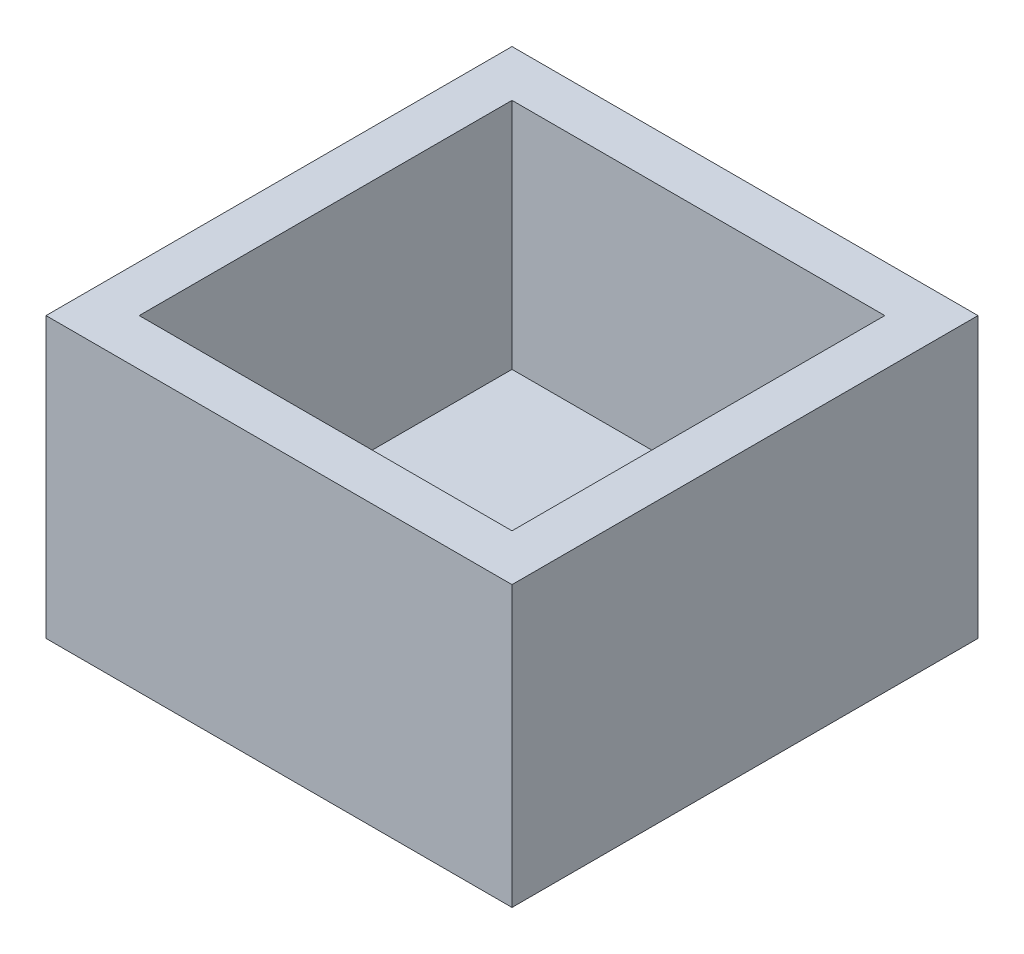
ISO-10303-21;
HEADER;
FILE_DESCRIPTION(('STEP AP214'),'2;1');
FILE_NAME('part.step','',(''),(''),'','','');
FILE_SCHEMA(('AUTOMOTIVE_DESIGN { 1 0 10303 214 1 1 1 1 }'));
ENDSEC;
DATA;
#1=APPLICATION_CONTEXT('core data for automotive mechanical design processes');
#2=APPLICATION_PROTOCOL_DEFINITION('international standard','automotive_design',2000,#1);
#3=PRODUCT_CONTEXT('',#1,'mechanical');
#4=PRODUCT('Part','Part','',(#3));
#5=PRODUCT_RELATED_PRODUCT_CATEGORY('part','',(#4));
#6=PRODUCT_DEFINITION_FORMATION('','',#4);
#7=PRODUCT_DEFINITION_CONTEXT('part definition',#1,'design');
#8=PRODUCT_DEFINITION('design','',#6,#7);
#9=PRODUCT_DEFINITION_SHAPE('','',#8);
#10=(LENGTH_UNIT() NAMED_UNIT(*) SI_UNIT(.MILLI.,.METRE.));
#11=(NAMED_UNIT(*) PLANE_ANGLE_UNIT() SI_UNIT($,.RADIAN.));
#12=(NAMED_UNIT(*) SI_UNIT($,.STERADIAN.) SOLID_ANGLE_UNIT());
#13=UNCERTAINTY_MEASURE_WITH_UNIT(LENGTH_MEASURE(1.E-05),#10,'distance_accuracy_value','');
#14=(GEOMETRIC_REPRESENTATION_CONTEXT(3) GLOBAL_UNCERTAINTY_ASSIGNED_CONTEXT((#13)) GLOBAL_UNIT_ASSIGNED_CONTEXT((#10,
#11,#12)) REPRESENTATION_CONTEXT('',''));
#15=CARTESIAN_POINT('',(0.,0.,0.));
#16=DIRECTION('',(0.,0.,1.));
#17=DIRECTION('',(1.,0.,0.));
#18=AXIS2_PLACEMENT_3D('',#15,#16,#17);
#19=CARTESIAN_POINT('',(0.,1.,0.));
#20=DIRECTION('',(1.,0.,0.));
#21=DIRECTION('',(0.,0.,-1.));
#22=AXIS2_PLACEMENT_3D('',#19,#20,#21);
#23=PLANE('',#22);
#24=DIRECTION('',(0.,0.,1.));
#25=VECTOR('',#24,1.);
#26=CARTESIAN_POINT('',(0.,0.,0.));
#27=LINE('',#26,#25);
#28=CARTESIAN_POINT('',(0.,0.,0.));
#29=VERTEX_POINT('',#28);
#30=CARTESIAN_POINT('',(0.,0.,10.));
#31=VERTEX_POINT('',#30);
#32=EDGE_CURVE('E167',#29,#31,#27,.T.);
#33=ORIENTED_EDGE('',*,*,#32,.T.);
#34=DIRECTION('',(0.,-1.,0.));
#35=VECTOR('',#34,1.);
#36=CARTESIAN_POINT('',(0.,1.,10.));
#37=LINE('',#36,#35);
#38=CARTESIAN_POINT('',(0.,6.,10.));
#39=VERTEX_POINT('',#38);
#40=EDGE_CURVE('E11',#39,#31,#37,.T.);
#41=ORIENTED_EDGE('',*,*,#40,.F.);
#42=DIRECTION('',(0.,0.,1.));
#43=VECTOR('',#42,1.);
#44=CARTESIAN_POINT('',(0.,6.,0.));
#45=LINE('',#44,#43);
#46=CARTESIAN_POINT('',(0.,6.,0.));
#47=VERTEX_POINT('',#46);
#48=EDGE_CURVE('E120',#47,#39,#45,.T.);
#49=ORIENTED_EDGE('',*,*,#48,.F.);
#50=DIRECTION('',(0.,-1.,0.));
#51=VECTOR('',#50,1.);
#52=CARTESIAN_POINT('',(0.,1.,0.));
#53=LINE('',#52,#51);
#54=EDGE_CURVE('E180',#47,#29,#53,.T.);
#55=ORIENTED_EDGE('',*,*,#54,.T.);
#56=EDGE_LOOP('',(#33,#41,#49,#55));
#57=FACE_BOUND('',#56,.T.);
#58=ADVANCED_FACE('F39',(#57),#23,.F.);
#59=CARTESIAN_POINT('',(0.,1.,10.));
#60=DIRECTION('',(0.,0.,-1.));
#61=DIRECTION('',(-1.,0.,0.));
#62=AXIS2_PLACEMENT_3D('',#59,#60,#61);
#63=PLANE('',#62);
#64=DIRECTION('',(1.,0.,0.));
#65=VECTOR('',#64,1.);
#66=CARTESIAN_POINT('',(0.,0.,10.));
#67=LINE('',#66,#65);
#68=CARTESIAN_POINT('',(10.,0.,10.));
#69=VERTEX_POINT('',#68);
#70=EDGE_CURVE('E171',#31,#69,#67,.T.);
#71=ORIENTED_EDGE('',*,*,#70,.T.);
#72=DIRECTION('',(0.,-1.,0.));
#73=VECTOR('',#72,1.);
#74=CARTESIAN_POINT('',(10.,1.,10.));
#75=LINE('',#74,#73);
#76=CARTESIAN_POINT('',(10.,6.,10.));
#77=VERTEX_POINT('',#76);
#78=EDGE_CURVE('E47',#77,#69,#75,.T.);
#79=ORIENTED_EDGE('',*,*,#78,.F.);
#80=DIRECTION('',(1.,0.,0.));
#81=VECTOR('',#80,1.);
#82=CARTESIAN_POINT('',(0.,6.,10.));
#83=LINE('',#82,#81);
#84=EDGE_CURVE('E155',#39,#77,#83,.T.);
#85=ORIENTED_EDGE('',*,*,#84,.F.);
#86=ORIENTED_EDGE('',*,*,#40,.T.);
#87=EDGE_LOOP('',(#71,#79,#85,#86));
#88=FACE_BOUND('',#87,.T.);
#89=ADVANCED_FACE('F205',(#88),#63,.F.);
#90=CARTESIAN_POINT('',(10.,1.,0.));
#91=DIRECTION('',(-1.,0.,0.));
#92=DIRECTION('',(0.,0.,1.));
#93=AXIS2_PLACEMENT_3D('',#90,#91,#92);
#94=PLANE('',#93);
#95=DIRECTION('',(0.,0.,-1.));
#96=VECTOR('',#95,1.);
#97=CARTESIAN_POINT('',(10.,0.,0.));
#98=LINE('',#97,#96);
#99=CARTESIAN_POINT('',(10.,0.,0.));
#100=VERTEX_POINT('',#99);
#101=EDGE_CURVE('E174',#69,#100,#98,.T.);
#102=ORIENTED_EDGE('',*,*,#101,.T.);
#103=DIRECTION('',(0.,-1.,0.));
#104=VECTOR('',#103,1.);
#105=CARTESIAN_POINT('',(10.,1.,0.));
#106=LINE('',#105,#104);
#107=CARTESIAN_POINT('',(10.,6.,0.));
#108=VERTEX_POINT('',#107);
#109=EDGE_CURVE('E184',#108,#100,#106,.T.);
#110=ORIENTED_EDGE('',*,*,#109,.F.);
#111=DIRECTION('',(0.,0.,-1.));
#112=VECTOR('',#111,1.);
#113=CARTESIAN_POINT('',(10.,6.,0.));
#114=LINE('',#113,#112);
#115=EDGE_CURVE('E159',#77,#108,#114,.T.);
#116=ORIENTED_EDGE('',*,*,#115,.F.);
#117=ORIENTED_EDGE('',*,*,#78,.T.);
#118=EDGE_LOOP('',(#102,#110,#116,#117));
#119=FACE_BOUND('',#118,.T.);
#120=ADVANCED_FACE('F192',(#119),#94,.F.);
#121=CARTESIAN_POINT('',(0.,1.,0.));
#122=DIRECTION('',(0.,0.,1.));
#123=DIRECTION('',(1.,0.,0.));
#124=AXIS2_PLACEMENT_3D('',#121,#122,#123);
#125=PLANE('',#124);
#126=DIRECTION('',(-1.,0.,0.));
#127=VECTOR('',#126,1.);
#128=CARTESIAN_POINT('',(0.,0.,0.));
#129=LINE('',#128,#127);
#130=EDGE_CURVE('E177',#100,#29,#129,.T.);
#131=ORIENTED_EDGE('',*,*,#130,.T.);
#132=ORIENTED_EDGE('',*,*,#54,.F.);
#133=DIRECTION('',(-1.,0.,0.));
#134=VECTOR('',#133,1.);
#135=CARTESIAN_POINT('',(0.,6.,0.));
#136=LINE('',#135,#134);
#137=EDGE_CURVE('E163',#108,#47,#136,.T.);
#138=ORIENTED_EDGE('',*,*,#137,.F.);
#139=ORIENTED_EDGE('',*,*,#109,.T.);
#140=EDGE_LOOP('',(#131,#132,#138,#139));
#141=FACE_BOUND('',#140,.T.);
#142=ADVANCED_FACE('F200',(#141),#125,.F.);
#143=CARTESIAN_POINT('',(0.,0.,0.));
#144=DIRECTION('',(0.,1.,0.));
#145=DIRECTION('',(0.,0.,1.));
#146=AXIS2_PLACEMENT_3D('',#143,#144,#145);
#147=PLANE('',#146);
#148=ORIENTED_EDGE('',*,*,#32,.F.);
#149=ORIENTED_EDGE('',*,*,#130,.F.);
#150=ORIENTED_EDGE('',*,*,#101,.F.);
#151=ORIENTED_EDGE('',*,*,#70,.F.);
#152=EDGE_LOOP('',(#148,#149,#150,#151));
#153=FACE_BOUND('',#152,.T.);
#154=ADVANCED_FACE('F198',(#153),#147,.F.);
#155=CARTESIAN_POINT('',(0.,6.,0.));
#156=DIRECTION('',(0.,1.,0.));
#157=DIRECTION('',(0.,0.,1.));
#158=AXIS2_PLACEMENT_3D('',#155,#156,#157);
#159=PLANE('',#158);
#160=ORIENTED_EDGE('',*,*,#48,.T.);
#161=ORIENTED_EDGE('',*,*,#84,.T.);
#162=ORIENTED_EDGE('',*,*,#115,.T.);
#163=ORIENTED_EDGE('',*,*,#137,.T.);
#164=EDGE_LOOP('',(#160,#161,#162,#163));
#165=FACE_BOUND('',#164,.T.);
#166=DIRECTION('',(1.,0.,0.));
#167=VECTOR('',#166,1.);
#168=CARTESIAN_POINT('',(0.999999999999999,6.,9.));
#169=LINE('',#168,#167);
#170=CARTESIAN_POINT('',(0.999999999999999,6.,9.));
#171=VERTEX_POINT('',#170);
#172=CARTESIAN_POINT('',(9.,6.,9.));
#173=VERTEX_POINT('',#172);
#174=EDGE_CURVE('E113',#171,#173,#169,.T.);
#175=ORIENTED_EDGE('',*,*,#174,.F.);
#176=DIRECTION('',(0.,0.,1.));
#177=VECTOR('',#176,1.);
#178=CARTESIAN_POINT('',(0.999999999999997,6.,1.));
#179=LINE('',#178,#177);
#180=CARTESIAN_POINT('',(0.999999999999997,6.,1.));
#181=VERTEX_POINT('',#180);
#182=EDGE_CURVE('E103',#181,#171,#179,.T.);
#183=ORIENTED_EDGE('',*,*,#182,.F.);
#184=DIRECTION('',(-1.,0.,0.));
#185=VECTOR('',#184,1.);
#186=CARTESIAN_POINT('',(0.999999999999997,6.,1.));
#187=LINE('',#186,#185);
#188=CARTESIAN_POINT('',(9.,6.,1.));
#189=VERTEX_POINT('',#188);
#190=EDGE_CURVE('E130',#189,#181,#187,.T.);
#191=ORIENTED_EDGE('',*,*,#190,.F.);
#192=DIRECTION('',(0.,0.,-1.));
#193=VECTOR('',#192,1.);
#194=CARTESIAN_POINT('',(9.,6.,1.));
#195=LINE('',#194,#193);
#196=EDGE_CURVE('E126',#173,#189,#195,.T.);
#197=ORIENTED_EDGE('',*,*,#196,.F.);
#198=EDGE_LOOP('',(#175,#183,#191,#197));
#199=FACE_BOUND('',#198,.T.);
#200=ADVANCED_FACE('F124',(#165,#199),#159,.T.);
#201=CARTESIAN_POINT('',(0.999999999999997,6.,1.));
#202=DIRECTION('',(1.,0.,0.));
#203=DIRECTION('',(0.,0.,-1.));
#204=AXIS2_PLACEMENT_3D('',#201,#202,#203);
#205=PLANE('',#204);
#206=DIRECTION('',(0.,0.,1.));
#207=VECTOR('',#206,1.);
#208=CARTESIAN_POINT('',(0.999999999999997,1.,1.));
#209=LINE('',#208,#207);
#210=CARTESIAN_POINT('',(0.999999999999997,1.,1.));
#211=VERTEX_POINT('',#210);
#212=CARTESIAN_POINT('',(0.999999999999999,1.,9.));
#213=VERTEX_POINT('',#212);
#214=EDGE_CURVE('E54',#211,#213,#209,.T.);
#215=ORIENTED_EDGE('',*,*,#214,.F.);
#216=DIRECTION('',(0.,-1.,0.));
#217=VECTOR('',#216,1.);
#218=CARTESIAN_POINT('',(0.999999999999997,6.,1.));
#219=LINE('',#218,#217);
#220=EDGE_CURVE('E108',#181,#211,#219,.T.);
#221=ORIENTED_EDGE('',*,*,#220,.F.);
#222=ORIENTED_EDGE('',*,*,#182,.T.);
#223=DIRECTION('',(0.,-1.,0.));
#224=VECTOR('',#223,1.);
#225=CARTESIAN_POINT('',(0.999999999999999,6.,9.));
#226=LINE('',#225,#224);
#227=EDGE_CURVE('E106',#171,#213,#226,.T.);
#228=ORIENTED_EDGE('',*,*,#227,.T.);
#229=EDGE_LOOP('',(#215,#221,#222,#228));
#230=FACE_BOUND('',#229,.T.);
#231=ADVANCED_FACE('F105',(#230),#205,.T.);
#232=CARTESIAN_POINT('',(0.999999999999999,6.,9.));
#233=DIRECTION('',(0.,0.,-1.));
#234=DIRECTION('',(-1.,0.,0.));
#235=AXIS2_PLACEMENT_3D('',#232,#233,#234);
#236=PLANE('',#235);
#237=DIRECTION('',(1.,0.,0.));
#238=VECTOR('',#237,1.);
#239=CARTESIAN_POINT('',(0.999999999999999,1.,9.));
#240=LINE('',#239,#238);
#241=CARTESIAN_POINT('',(9.,1.,9.));
#242=VERTEX_POINT('',#241);
#243=EDGE_CURVE('E58',#213,#242,#240,.T.);
#244=ORIENTED_EDGE('',*,*,#243,.F.);
#245=ORIENTED_EDGE('',*,*,#227,.F.);
#246=ORIENTED_EDGE('',*,*,#174,.T.);
#247=DIRECTION('',(0.,-1.,0.));
#248=VECTOR('',#247,1.);
#249=CARTESIAN_POINT('',(9.,6.,9.));
#250=LINE('',#249,#248);
#251=EDGE_CURVE('E121',#173,#242,#250,.T.);
#252=ORIENTED_EDGE('',*,*,#251,.T.);
#253=EDGE_LOOP('',(#244,#245,#246,#252));
#254=FACE_BOUND('',#253,.T.);
#255=ADVANCED_FACE('F117',(#254),#236,.T.);
#256=CARTESIAN_POINT('',(9.,6.,1.));
#257=DIRECTION('',(-1.,0.,0.));
#258=DIRECTION('',(0.,0.,1.));
#259=AXIS2_PLACEMENT_3D('',#256,#257,#258);
#260=PLANE('',#259);
#261=DIRECTION('',(0.,0.,-1.));
#262=VECTOR('',#261,1.);
#263=CARTESIAN_POINT('',(9.,1.,1.));
#264=LINE('',#263,#262);
#265=CARTESIAN_POINT('',(9.,1.,1.));
#266=VERTEX_POINT('',#265);
#267=EDGE_CURVE('E139',#242,#266,#264,.T.);
#268=ORIENTED_EDGE('',*,*,#267,.F.);
#269=ORIENTED_EDGE('',*,*,#251,.F.);
#270=ORIENTED_EDGE('',*,*,#196,.T.);
#271=DIRECTION('',(0.,-1.,0.));
#272=VECTOR('',#271,1.);
#273=CARTESIAN_POINT('',(9.,6.,1.));
#274=LINE('',#273,#272);
#275=EDGE_CURVE('E146',#189,#266,#274,.T.);
#276=ORIENTED_EDGE('',*,*,#275,.T.);
#277=EDGE_LOOP('',(#268,#269,#270,#276));
#278=FACE_BOUND('',#277,.T.);
#279=ADVANCED_FACE('F227',(#278),#260,.T.);
#280=CARTESIAN_POINT('',(0.999999999999997,6.,1.));
#281=DIRECTION('',(0.,0.,1.));
#282=DIRECTION('',(1.,0.,0.));
#283=AXIS2_PLACEMENT_3D('',#280,#281,#282);
#284=PLANE('',#283);
#285=DIRECTION('',(-1.,0.,0.));
#286=VECTOR('',#285,1.);
#287=CARTESIAN_POINT('',(0.999999999999997,1.,1.));
#288=LINE('',#287,#286);
#289=EDGE_CURVE('E114',#266,#211,#288,.T.);
#290=ORIENTED_EDGE('',*,*,#289,.F.);
#291=ORIENTED_EDGE('',*,*,#275,.F.);
#292=ORIENTED_EDGE('',*,*,#190,.T.);
#293=ORIENTED_EDGE('',*,*,#220,.T.);
#294=EDGE_LOOP('',(#290,#291,#292,#293));
#295=FACE_BOUND('',#294,.T.);
#296=ADVANCED_FACE('F220',(#295),#284,.T.);
#297=CARTESIAN_POINT('',(0.,1.,0.));
#298=DIRECTION('',(0.,1.,0.));
#299=DIRECTION('',(0.,0.,1.));
#300=AXIS2_PLACEMENT_3D('',#297,#298,#299);
#301=PLANE('',#300);
#302=ORIENTED_EDGE('',*,*,#214,.T.);
#303=ORIENTED_EDGE('',*,*,#243,.T.);
#304=ORIENTED_EDGE('',*,*,#267,.T.);
#305=ORIENTED_EDGE('',*,*,#289,.T.);
#306=EDGE_LOOP('',(#302,#303,#304,#305));
#307=FACE_BOUND('',#306,.T.);
#308=ADVANCED_FACE('F217',(#307),#301,.T.);
#309=CLOSED_SHELL('',(#58,#89,#120,#142,#154,#200,#231,#255,#279,#296,#308));
#310=MANIFOLD_SOLID_BREP('B2',#309);
#311=ADVANCED_BREP_SHAPE_REPRESENTATION('',(#18,#310),#14);
#312=SHAPE_DEFINITION_REPRESENTATION(#9,#311);
ENDSEC;
END-ISO-10303-21;
